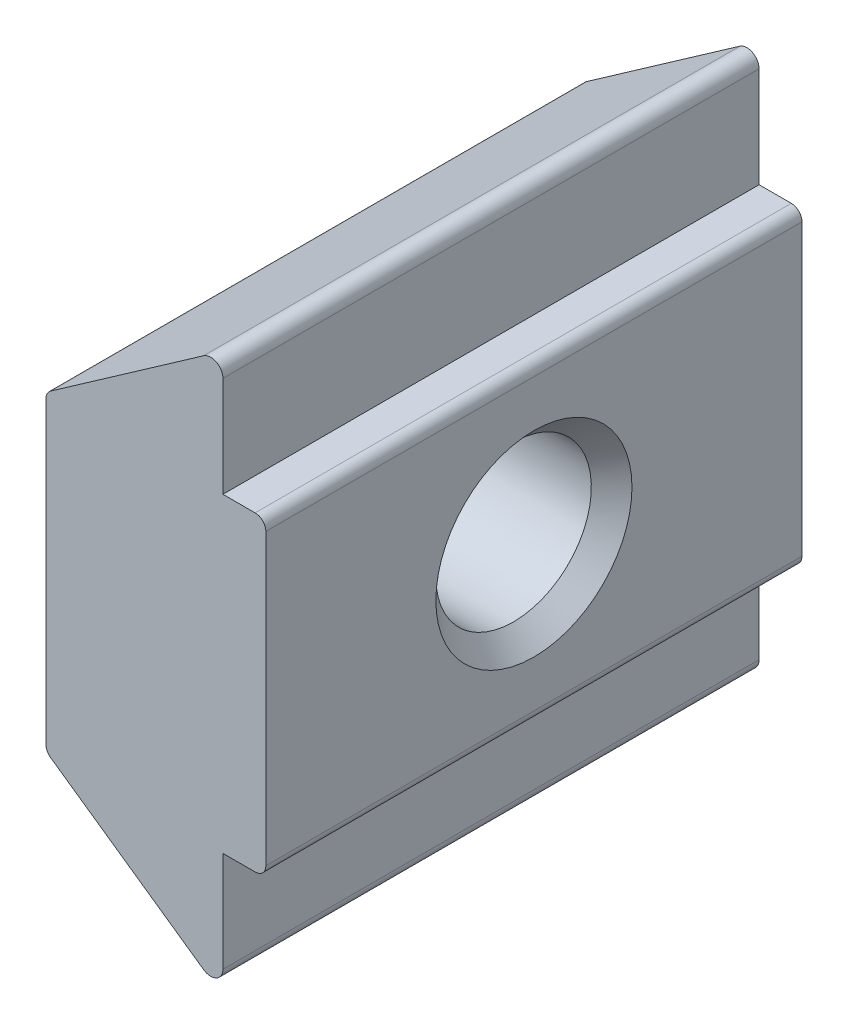
ISO-10303-21;
HEADER;
FILE_DESCRIPTION(('STEP AP214'),'2;1');
FILE_NAME('part.step','',(''),(''),'','','');
FILE_SCHEMA(('AUTOMOTIVE_DESIGN { 1 0 10303 214 1 1 1 1 }'));
ENDSEC;
DATA;
#1=APPLICATION_CONTEXT('core data for automotive mechanical design processes');
#2=APPLICATION_PROTOCOL_DEFINITION('international standard','automotive_design',2000,#1);
#3=PRODUCT_CONTEXT('',#1,'mechanical');
#4=PRODUCT('Part','Part','',(#3));
#5=PRODUCT_RELATED_PRODUCT_CATEGORY('part','',(#4));
#6=PRODUCT_DEFINITION_FORMATION('','',#4);
#7=PRODUCT_DEFINITION_CONTEXT('part definition',#1,'design');
#8=PRODUCT_DEFINITION('design','',#6,#7);
#9=PRODUCT_DEFINITION_SHAPE('','',#8);
#10=(LENGTH_UNIT() NAMED_UNIT(*) SI_UNIT(.MILLI.,.METRE.));
#11=(NAMED_UNIT(*) PLANE_ANGLE_UNIT() SI_UNIT($,.RADIAN.));
#12=(NAMED_UNIT(*) SI_UNIT($,.STERADIAN.) SOLID_ANGLE_UNIT());
#13=UNCERTAINTY_MEASURE_WITH_UNIT(LENGTH_MEASURE(1.E-05),#10,'distance_accuracy_value','');
#14=(GEOMETRIC_REPRESENTATION_CONTEXT(3) GLOBAL_UNCERTAINTY_ASSIGNED_CONTEXT((#13)) GLOBAL_UNIT_ASSIGNED_CONTEXT((#10,
#11,#12)) REPRESENTATION_CONTEXT('',''));
#15=CARTESIAN_POINT('',(0.,0.,0.));
#16=DIRECTION('',(0.,0.,1.));
#17=DIRECTION('',(1.,0.,0.));
#18=AXIS2_PLACEMENT_3D('',#15,#16,#17);
#19=CARTESIAN_POINT('',(-0.799999999997916,-4.7718984664115,-5.));
#20=DIRECTION('',(1.,0.,0.));
#21=DIRECTION('',(0.,1.,0.));
#22=AXIS2_PLACEMENT_3D('',#19,#20,#21);
#23=PLANE('',#22);
#24=DIRECTION('',(0.,1.,0.));
#25=VECTOR('',#24,1.);
#26=CARTESIAN_POINT('',(-0.799999999997916,-4.7718984664115,5.));
#27=LINE('',#26,#25);
#28=CARTESIAN_POINT('',(-0.799999999997916,2.9,5.));
#29=VERTEX_POINT('',#28);
#30=CARTESIAN_POINT('',(-0.799999999997916,4.77189846641149,5.));
#31=VERTEX_POINT('',#30);
#32=EDGE_CURVE('E162',#29,#31,#27,.T.);
#33=ORIENTED_EDGE('',*,*,#32,.F.);
#34=DIRECTION('',(0.,0.,1.));
#35=VECTOR('',#34,1.);
#36=CARTESIAN_POINT('',(-0.799999999997916,2.9,5.));
#37=LINE('',#36,#35);
#38=CARTESIAN_POINT('',(-0.799999999997916,2.9,-5.));
#39=VERTEX_POINT('',#38);
#40=EDGE_CURVE('E155',#39,#29,#37,.T.);
#41=ORIENTED_EDGE('',*,*,#40,.F.);
#42=DIRECTION('',(0.,1.,0.));
#43=VECTOR('',#42,1.);
#44=CARTESIAN_POINT('',(-0.799999999997916,-4.7718984664115,-5.));
#45=LINE('',#44,#43);
#46=CARTESIAN_POINT('',(-0.799999999997916,4.77189846641149,-5.));
#47=VERTEX_POINT('',#46);
#48=EDGE_CURVE('E241',#39,#47,#45,.T.);
#49=ORIENTED_EDGE('',*,*,#48,.T.);
#50=DIRECTION('',(0.,0.,1.));
#51=VECTOR('',#50,1.);
#52=CARTESIAN_POINT('',(-0.799999999997916,4.77189846641149,-5.));
#53=LINE('',#52,#51);
#54=EDGE_CURVE('E183',#47,#31,#53,.T.);
#55=ORIENTED_EDGE('',*,*,#54,.T.);
#56=EDGE_LOOP('',(#33,#41,#49,#55));
#57=FACE_BOUND('',#56,.T.);
#58=ADVANCED_FACE('F35',(#57),#23,.T.);
#59=CARTESIAN_POINT('',(-0.799999999997916,-4.7718984664115,-5.));
#60=VERTEX_POINT('',#59);
#61=CARTESIAN_POINT('',(-0.799999999997916,-2.9,-5.));
#62=VERTEX_POINT('',#61);
#63=EDGE_CURVE('E153',#60,#62,#45,.T.);
#64=ORIENTED_EDGE('',*,*,#63,.T.);
#65=DIRECTION('',(0.,0.,-1.));
#66=VECTOR('',#65,1.);
#67=CARTESIAN_POINT('',(-0.799999999997916,-2.9,-5.));
#68=LINE('',#67,#66);
#69=CARTESIAN_POINT('',(-0.799999999997916,-2.9,5.));
#70=VERTEX_POINT('',#69);
#71=EDGE_CURVE('E138',#70,#62,#68,.T.);
#72=ORIENTED_EDGE('',*,*,#71,.F.);
#73=CARTESIAN_POINT('',(-0.799999999997916,-4.7718984664115,5.));
#74=VERTEX_POINT('',#73);
#75=EDGE_CURVE('E150',#74,#70,#27,.T.);
#76=ORIENTED_EDGE('',*,*,#75,.F.);
#77=DIRECTION('',(0.,0.,1.));
#78=VECTOR('',#77,1.);
#79=CARTESIAN_POINT('',(-0.799999999997916,-4.7718984664115,-5.));
#80=LINE('',#79,#78);
#81=EDGE_CURVE('E186',#60,#74,#80,.T.);
#82=ORIENTED_EDGE('',*,*,#81,.F.);
#83=EDGE_LOOP('',(#64,#72,#76,#82));
#84=FACE_BOUND('',#83,.T.);
#85=ADVANCED_FACE('F149',(#84),#23,.T.);
#86=CARTESIAN_POINT('',(-1.02809999999535,-4.7718984664115,-5.));
#87=DIRECTION('',(0.,0.,1.));
#88=DIRECTION('',(1.,0.,0.));
#89=AXIS2_PLACEMENT_3D('',#86,#87,#88);
#90=CYLINDRICAL_SURFACE('',#89,0.228099999997434);
#91=CARTESIAN_POINT('',(-1.02809999999535,-4.7718984664115,5.));
#92=DIRECTION('',(0.,0.,1.));
#93=DIRECTION('',(1.,0.,0.));
#94=AXIS2_PLACEMENT_3D('',#91,#92,#93);
#95=CIRCLE('',#94,0.228099999997434);
#96=CARTESIAN_POINT('',(-1.15890676074315,-4.95876526747979,5.));
#97=VERTEX_POINT('',#96);
#98=EDGE_CURVE('E160',#97,#74,#95,.T.);
#99=ORIENTED_EDGE('',*,*,#98,.F.);
#100=DIRECTION('',(0.,0.,1.));
#101=VECTOR('',#100,1.);
#102=CARTESIAN_POINT('',(-1.15890676074315,-4.95876526747979,-5.));
#103=LINE('',#102,#101);
#104=CARTESIAN_POINT('',(-1.15890676074315,-4.95876526747979,-5.));
#105=VERTEX_POINT('',#104);
#106=EDGE_CURVE('E177',#105,#97,#103,.T.);
#107=ORIENTED_EDGE('',*,*,#106,.F.);
#108=CARTESIAN_POINT('',(-1.02809999999535,-4.7718984664115,-5.));
#109=DIRECTION('',(0.,0.,1.));
#110=DIRECTION('',(1.,0.,0.));
#111=AXIS2_PLACEMENT_3D('',#108,#109,#110);
#112=CIRCLE('',#111,0.228099999997434);
#113=EDGE_CURVE('E176',#105,#60,#112,.T.);
#114=ORIENTED_EDGE('',*,*,#113,.T.);
#115=ORIENTED_EDGE('',*,*,#81,.T.);
#116=EDGE_LOOP('',(#99,#107,#114,#115));
#117=FACE_BOUND('',#116,.T.);
#118=ADVANCED_FACE('F276',(#117),#90,.T.);
#119=CARTESIAN_POINT('',(-4.1,-2.9,-5.));
#120=DIRECTION('',(-0.573462344363329,-0.81923192051904,0.));
#121=DIRECTION('',(0.81923192051904,-0.573462344363329,0.));
#122=AXIS2_PLACEMENT_3D('',#119,#120,#121);
#123=PLANE('',#122);
#124=DIRECTION('',(0.81923192051904,-0.573462344363329,0.));
#125=VECTOR('',#124,1.);
#126=CARTESIAN_POINT('',(-4.1,-2.9,5.));
#127=LINE('',#126,#125);
#128=CARTESIAN_POINT('',(-4.01469246887267,-2.95971527178913,5.));
#129=VERTEX_POINT('',#128);
#130=EDGE_CURVE('E174',#129,#97,#127,.T.);
#131=ORIENTED_EDGE('',*,*,#130,.F.);
#132=DIRECTION('',(0.,0.,1.));
#133=VECTOR('',#132,1.);
#134=CARTESIAN_POINT('',(-4.01469246887267,-2.95971527178913,-5.));
#135=LINE('',#134,#133);
#136=CARTESIAN_POINT('',(-4.01469246887267,-2.95971527178913,-5.));
#137=VERTEX_POINT('',#136);
#138=EDGE_CURVE('E213',#129,#137,#135,.F.);
#139=ORIENTED_EDGE('',*,*,#138,.T.);
#140=DIRECTION('',(0.81923192051904,-0.573462344363329,0.));
#141=VECTOR('',#140,1.);
#142=CARTESIAN_POINT('',(-4.1,-2.9,-5.));
#143=LINE('',#142,#141);
#144=EDGE_CURVE('E188',#137,#105,#143,.T.);
#145=ORIENTED_EDGE('',*,*,#144,.T.);
#146=ORIENTED_EDGE('',*,*,#106,.T.);
#147=EDGE_LOOP('',(#131,#139,#145,#146));
#148=FACE_BOUND('',#147,.T.);
#149=ADVANCED_FACE('F271',(#148),#123,.T.);
#150=CARTESIAN_POINT('',(-4.1,2.9,-5.));
#151=DIRECTION('',(-1.,0.,0.));
#152=DIRECTION('',(0.,0.,1.));
#153=AXIS2_PLACEMENT_3D('',#150,#151,#152);
#154=PLANE('',#153);
#155=CARTESIAN_POINT('',(-4.1,0.,0.));
#156=DIRECTION('',(-1.,0.,0.));
#157=DIRECTION('',(0.,0.,1.));
#158=AXIS2_PLACEMENT_3D('',#155,#156,#157);
#159=CIRCLE('',#158,1.82899999994793);
#160=CARTESIAN_POINT('',(-4.1,0.,1.82899999994793));
#161=VERTEX_POINT('',#160);
#162=EDGE_CURVE('E180',#161,#161,#159,.F.);
#163=ORIENTED_EDGE('',*,*,#162,.T.);
#164=EDGE_LOOP('',(#163));
#165=FACE_BOUND('',#164,.T.);
#166=DIRECTION('',(0.,-1.,0.));
#167=VECTOR('',#166,1.);
#168=CARTESIAN_POINT('',(-4.1,2.9,-5.));
#169=LINE('',#168,#167);
#170=CARTESIAN_POINT('',(-4.1,2.79586888768533,-5.));
#171=VERTEX_POINT('',#170);
#172=CARTESIAN_POINT('',(-4.1,-2.79586888768532,-5.));
#173=VERTEX_POINT('',#172);
#174=EDGE_CURVE('E266',#171,#173,#169,.T.);
#175=ORIENTED_EDGE('',*,*,#174,.T.);
#176=DIRECTION('',(0.,0.,1.));
#177=VECTOR('',#176,1.);
#178=CARTESIAN_POINT('',(-4.1,-2.79586888768533,-5.));
#179=LINE('',#178,#177);
#180=CARTESIAN_POINT('',(-4.1,-2.79586888768532,5.));
#181=VERTEX_POINT('',#180);
#182=EDGE_CURVE('E202',#173,#181,#179,.T.);
#183=ORIENTED_EDGE('',*,*,#182,.T.);
#184=DIRECTION('',(0.,-1.,0.));
#185=VECTOR('',#184,1.);
#186=CARTESIAN_POINT('',(-4.1,2.9,5.));
#187=LINE('',#186,#185);
#188=CARTESIAN_POINT('',(-4.1,2.79586888768533,5.));
#189=VERTEX_POINT('',#188);
#190=EDGE_CURVE('E172',#189,#181,#187,.T.);
#191=ORIENTED_EDGE('',*,*,#190,.F.);
#192=DIRECTION('',(0.,0.,1.));
#193=VECTOR('',#192,1.);
#194=CARTESIAN_POINT('',(-4.1,2.79586888768533,-5.));
#195=LINE('',#194,#193);
#196=EDGE_CURVE('E200',#189,#171,#195,.F.);
#197=ORIENTED_EDGE('',*,*,#196,.T.);
#198=EDGE_LOOP('',(#175,#183,#191,#197));
#199=FACE_BOUND('',#198,.T.);
#200=ADVANCED_FACE('F326',(#165,#199),#154,.T.);
#201=CARTESIAN_POINT('',(-1.15890676074317,4.95876526747979,-5.));
#202=DIRECTION('',(-0.573462344363328,0.81923192051904,0.));
#203=DIRECTION('',(-0.81923192051904,-0.573462344363328,0.));
#204=AXIS2_PLACEMENT_3D('',#201,#202,#203);
#205=PLANE('',#204);
#206=DIRECTION('',(-0.81923192051904,-0.573462344363328,0.));
#207=VECTOR('',#206,1.);
#208=CARTESIAN_POINT('',(-1.15890676074317,4.95876526747979,-5.));
#209=LINE('',#208,#207);
#210=CARTESIAN_POINT('',(-1.15890676074317,4.95876526747979,-5.));
#211=VERTEX_POINT('',#210);
#212=CARTESIAN_POINT('',(-4.01469246887267,2.95971527178914,-5.));
#213=VERTEX_POINT('',#212);
#214=EDGE_CURVE('E263',#211,#213,#209,.T.);
#215=ORIENTED_EDGE('',*,*,#214,.T.);
#216=DIRECTION('',(0.,0.,1.));
#217=VECTOR('',#216,1.);
#218=CARTESIAN_POINT('',(-4.01469246887267,2.95971527178914,-5.));
#219=LINE('',#218,#217);
#220=CARTESIAN_POINT('',(-4.01469246887267,2.95971527178914,5.));
#221=VERTEX_POINT('',#220);
#222=EDGE_CURVE('E221',#213,#221,#219,.T.);
#223=ORIENTED_EDGE('',*,*,#222,.T.);
#224=DIRECTION('',(-0.81923192051904,-0.573462344363328,0.));
#225=VECTOR('',#224,1.);
#226=CARTESIAN_POINT('',(-1.15890676074317,4.95876526747979,5.));
#227=LINE('',#226,#225);
#228=CARTESIAN_POINT('',(-1.15890676074317,4.95876526747979,5.));
#229=VERTEX_POINT('',#228);
#230=EDGE_CURVE('E165',#229,#221,#227,.T.);
#231=ORIENTED_EDGE('',*,*,#230,.F.);
#232=DIRECTION('',(0.,0.,1.));
#233=VECTOR('',#232,1.);
#234=CARTESIAN_POINT('',(-1.15890676074317,4.95876526747979,-5.));
#235=LINE('',#234,#233);
#236=EDGE_CURVE('E181',#211,#229,#235,.T.);
#237=ORIENTED_EDGE('',*,*,#236,.F.);
#238=EDGE_LOOP('',(#215,#223,#231,#237));
#239=FACE_BOUND('',#238,.T.);
#240=ADVANCED_FACE('F319',(#239),#205,.T.);
#241=CARTESIAN_POINT('',(-1.02809999999536,4.77189846641149,-5.));
#242=DIRECTION('',(0.,0.,1.));
#243=DIRECTION('',(1.,0.,0.));
#244=AXIS2_PLACEMENT_3D('',#241,#242,#243);
#245=CYLINDRICAL_SURFACE('',#244,0.228099999997443);
#246=CARTESIAN_POINT('',(-1.02809999999536,4.77189846641149,5.));
#247=DIRECTION('',(0.,0.,1.));
#248=DIRECTION('',(1.,0.,0.));
#249=AXIS2_PLACEMENT_3D('',#246,#247,#248);
#250=CIRCLE('',#249,0.228099999997443);
#251=EDGE_CURVE('E161',#31,#229,#250,.T.);
#252=ORIENTED_EDGE('',*,*,#251,.F.);
#253=ORIENTED_EDGE('',*,*,#54,.F.);
#254=CARTESIAN_POINT('',(-1.02809999999536,4.77189846641149,-5.));
#255=DIRECTION('',(0.,0.,1.));
#256=DIRECTION('',(1.,0.,0.));
#257=AXIS2_PLACEMENT_3D('',#254,#255,#256);
#258=CIRCLE('',#257,0.228099999997443);
#259=EDGE_CURVE('E260',#47,#211,#258,.T.);
#260=ORIENTED_EDGE('',*,*,#259,.T.);
#261=ORIENTED_EDGE('',*,*,#236,.T.);
#262=EDGE_LOOP('',(#252,#253,#260,#261));
#263=FACE_BOUND('',#262,.T.);
#264=ADVANCED_FACE('F292',(#263),#245,.T.);
#265=CARTESIAN_POINT('',(-1.02809999999535,-4.7718984664115,-5.));
#266=DIRECTION('',(0.,0.,1.));
#267=DIRECTION('',(1.,0.,0.));
#268=AXIS2_PLACEMENT_3D('',#265,#266,#267);
#269=PLANE('',#268);
#270=ORIENTED_EDGE('',*,*,#144,.F.);
#271=CARTESIAN_POINT('',(-3.9,-2.79586888768533,-5.));
#272=DIRECTION('',(0.,0.,1.));
#273=DIRECTION('',(1.,0.,0.));
#274=AXIS2_PLACEMENT_3D('',#271,#272,#273);
#275=CIRCLE('',#274,0.200000000000001);
#276=EDGE_CURVE('E219',#137,#173,#275,.F.);
#277=ORIENTED_EDGE('',*,*,#276,.T.);
#278=ORIENTED_EDGE('',*,*,#174,.F.);
#279=CARTESIAN_POINT('',(-3.9,2.79586888768533,-5.));
#280=DIRECTION('',(0.,0.,1.));
#281=DIRECTION('',(1.,0.,0.));
#282=AXIS2_PLACEMENT_3D('',#279,#280,#281);
#283=CIRCLE('',#282,0.200000000000001);
#284=EDGE_CURVE('E217',#171,#213,#283,.F.);
#285=ORIENTED_EDGE('',*,*,#284,.T.);
#286=ORIENTED_EDGE('',*,*,#214,.F.);
#287=ORIENTED_EDGE('',*,*,#259,.F.);
#288=ORIENTED_EDGE('',*,*,#48,.F.);
#289=DIRECTION('',(-1.,0.,0.));
#290=VECTOR('',#289,1.);
#291=CARTESIAN_POINT('',(2.08416183616889E-12,2.9,-5.));
#292=LINE('',#291,#290);
#293=CARTESIAN_POINT('',(-0.199999999997917,2.9,-5.));
#294=VERTEX_POINT('',#293);
#295=EDGE_CURVE('E234',#294,#39,#292,.T.);
#296=ORIENTED_EDGE('',*,*,#295,.F.);
#297=CARTESIAN_POINT('',(-0.199999999997917,2.7,-5.));
#298=DIRECTION('',(0.,0.,1.));
#299=DIRECTION('',(1.,0.,0.));
#300=AXIS2_PLACEMENT_3D('',#297,#298,#299);
#301=CIRCLE('',#300,0.200000000000001);
#302=CARTESIAN_POINT('',(2.08414688165616E-12,2.7,-5.));
#303=VERTEX_POINT('',#302);
#304=EDGE_CURVE('E56',#294,#303,#301,.F.);
#305=ORIENTED_EDGE('',*,*,#304,.T.);
#306=DIRECTION('',(0.,1.,0.));
#307=VECTOR('',#306,1.);
#308=CARTESIAN_POINT('',(2.08416183616889E-12,2.9,-5.));
#309=LINE('',#308,#307);
#310=CARTESIAN_POINT('',(2.08374310981261E-12,-2.7,-5.));
#311=VERTEX_POINT('',#310);
#312=EDGE_CURVE('E242',#311,#303,#309,.T.);
#313=ORIENTED_EDGE('',*,*,#312,.F.);
#314=CARTESIAN_POINT('',(-0.199999999997917,-2.7,-5.));
#315=DIRECTION('',(0.,0.,1.));
#316=DIRECTION('',(1.,0.,0.));
#317=AXIS2_PLACEMENT_3D('',#314,#315,#316);
#318=CIRCLE('',#317,0.200000000000001);
#319=CARTESIAN_POINT('',(-0.199999999997917,-2.9,-5.));
#320=VERTEX_POINT('',#319);
#321=EDGE_CURVE('E50',#311,#320,#318,.F.);
#322=ORIENTED_EDGE('',*,*,#321,.T.);
#323=DIRECTION('',(-1.,0.,0.));
#324=VECTOR('',#323,1.);
#325=CARTESIAN_POINT('',(2.08372815529989E-12,-2.9,-5.));
#326=LINE('',#325,#324);
#327=EDGE_CURVE('E145',#320,#62,#326,.T.);
#328=ORIENTED_EDGE('',*,*,#327,.T.);
#329=ORIENTED_EDGE('',*,*,#63,.F.);
#330=ORIENTED_EDGE('',*,*,#113,.F.);
#331=EDGE_LOOP('',(#270,#277,#278,#285,#286,#287,#288,#296,#305,#313,#322,#328,#329,#330));
#332=FACE_BOUND('',#331,.T.);
#333=ADVANCED_FACE('F239',(#332),#269,.F.);
#334=CARTESIAN_POINT('',(-1.02809999999535,-4.7718984664115,5.));
#335=DIRECTION('',(0.,0.,1.));
#336=DIRECTION('',(1.,0.,0.));
#337=AXIS2_PLACEMENT_3D('',#334,#335,#336);
#338=PLANE('',#337);
#339=ORIENTED_EDGE('',*,*,#190,.T.);
#340=CARTESIAN_POINT('',(-3.9,-2.79586888768533,5.));
#341=DIRECTION('',(0.,0.,1.));
#342=DIRECTION('',(1.,0.,0.));
#343=AXIS2_PLACEMENT_3D('',#340,#341,#342);
#344=CIRCLE('',#343,0.200000000000001);
#345=EDGE_CURVE('E211',#181,#129,#344,.T.);
#346=ORIENTED_EDGE('',*,*,#345,.T.);
#347=ORIENTED_EDGE('',*,*,#130,.T.);
#348=ORIENTED_EDGE('',*,*,#98,.T.);
#349=ORIENTED_EDGE('',*,*,#75,.T.);
#350=DIRECTION('',(-1.,0.,0.));
#351=VECTOR('',#350,1.);
#352=CARTESIAN_POINT('',(2.08372815529989E-12,-2.9,5.));
#353=LINE('',#352,#351);
#354=CARTESIAN_POINT('',(-0.199999999997917,-2.9,5.));
#355=VERTEX_POINT('',#354);
#356=EDGE_CURVE('E135',#355,#70,#353,.T.);
#357=ORIENTED_EDGE('',*,*,#356,.F.);
#358=CARTESIAN_POINT('',(-0.199999999997917,-2.7,5.));
#359=DIRECTION('',(0.,0.,1.));
#360=DIRECTION('',(1.,0.,0.));
#361=AXIS2_PLACEMENT_3D('',#358,#359,#360);
#362=CIRCLE('',#361,0.200000000000001);
#363=CARTESIAN_POINT('',(2.08374310981261E-12,-2.7,5.));
#364=VERTEX_POINT('',#363);
#365=EDGE_CURVE('E205',#355,#364,#362,.T.);
#366=ORIENTED_EDGE('',*,*,#365,.T.);
#367=DIRECTION('',(0.,-1.,0.));
#368=VECTOR('',#367,1.);
#369=CARTESIAN_POINT('',(2.08372815529989E-12,-2.9,5.));
#370=LINE('',#369,#368);
#371=CARTESIAN_POINT('',(2.08414688165616E-12,2.7,5.));
#372=VERTEX_POINT('',#371);
#373=EDGE_CURVE('E154',#372,#364,#370,.T.);
#374=ORIENTED_EDGE('',*,*,#373,.F.);
#375=CARTESIAN_POINT('',(-0.199999999997917,2.7,5.));
#376=DIRECTION('',(0.,0.,1.));
#377=DIRECTION('',(1.,0.,0.));
#378=AXIS2_PLACEMENT_3D('',#375,#376,#377);
#379=CIRCLE('',#378,0.200000000000001);
#380=CARTESIAN_POINT('',(-0.199999999997917,2.9,5.));
#381=VERTEX_POINT('',#380);
#382=EDGE_CURVE('E207',#372,#381,#379,.T.);
#383=ORIENTED_EDGE('',*,*,#382,.T.);
#384=DIRECTION('',(-1.,0.,0.));
#385=VECTOR('',#384,1.);
#386=CARTESIAN_POINT('',(2.08416183616889E-12,2.9,5.));
#387=LINE('',#386,#385);
#388=EDGE_CURVE('E144',#381,#29,#387,.T.);
#389=ORIENTED_EDGE('',*,*,#388,.T.);
#390=ORIENTED_EDGE('',*,*,#32,.T.);
#391=ORIENTED_EDGE('',*,*,#251,.T.);
#392=ORIENTED_EDGE('',*,*,#230,.T.);
#393=CARTESIAN_POINT('',(-3.9,2.79586888768533,5.));
#394=DIRECTION('',(0.,0.,1.));
#395=DIRECTION('',(1.,0.,0.));
#396=AXIS2_PLACEMENT_3D('',#393,#394,#395);
#397=CIRCLE('',#396,0.200000000000001);
#398=EDGE_CURVE('E209',#221,#189,#397,.T.);
#399=ORIENTED_EDGE('',*,*,#398,.T.);
#400=EDGE_LOOP('',(#339,#346,#347,#348,#349,#357,#366,#374,#383,#389,#390,#391,#392,#399));
#401=FACE_BOUND('',#400,.T.);
#402=ADVANCED_FACE('F158',(#401),#338,.T.);
#403=CARTESIAN_POINT('',(2.08416183616889E-12,2.9,5.));
#404=DIRECTION('',(0.,-1.,0.));
#405=DIRECTION('',(1.,0.,0.));
#406=AXIS2_PLACEMENT_3D('',#403,#404,#405);
#407=PLANE('',#406);
#408=ORIENTED_EDGE('',*,*,#388,.F.);
#409=DIRECTION('',(0.,0.,1.));
#410=VECTOR('',#409,1.);
#411=CARTESIAN_POINT('',(-0.199999999997917,2.9,5.));
#412=LINE('',#411,#410);
#413=EDGE_CURVE('E43',#381,#294,#412,.F.);
#414=ORIENTED_EDGE('',*,*,#413,.T.);
#415=ORIENTED_EDGE('',*,*,#295,.T.);
#416=ORIENTED_EDGE('',*,*,#40,.T.);
#417=EDGE_LOOP('',(#408,#414,#415,#416));
#418=FACE_BOUND('',#417,.T.);
#419=ADVANCED_FACE('F232',(#418),#407,.F.);
#420=CARTESIAN_POINT('',(2.08372815529989E-12,-2.9,-5.));
#421=DIRECTION('',(0.,1.,0.));
#422=DIRECTION('',(-1.,0.,0.));
#423=AXIS2_PLACEMENT_3D('',#420,#421,#422);
#424=PLANE('',#423);
#425=ORIENTED_EDGE('',*,*,#327,.F.);
#426=DIRECTION('',(0.,0.,-1.));
#427=VECTOR('',#426,1.);
#428=CARTESIAN_POINT('',(-0.199999999997917,-2.9,-5.));
#429=LINE('',#428,#427);
#430=EDGE_CURVE('E11',#320,#355,#429,.F.);
#431=ORIENTED_EDGE('',*,*,#430,.T.);
#432=ORIENTED_EDGE('',*,*,#356,.T.);
#433=ORIENTED_EDGE('',*,*,#71,.T.);
#434=EDGE_LOOP('',(#425,#431,#432,#433));
#435=FACE_BOUND('',#434,.T.);
#436=ADVANCED_FACE('F137',(#435),#424,.F.);
#437=CARTESIAN_POINT('',(2.08394499573439E-12,0.,0.));
#438=DIRECTION('',(-1.,0.,0.));
#439=DIRECTION('',(0.,-1.,0.));
#440=AXIS2_PLACEMENT_3D('',#437,#438,#439);
#441=PLANE('',#440);
#442=CARTESIAN_POINT('',(2.08394499573439E-12,0.,0.));
#443=DIRECTION('',(-1.,0.,0.));
#444=DIRECTION('',(0.,-1.,0.));
#445=AXIS2_PLACEMENT_3D('',#442,#443,#444);
#446=CIRCLE('',#445,1.82899999995002);
#447=CARTESIAN_POINT('',(2.08380823671553E-12,-1.82899999995002,0.));
#448=VERTEX_POINT('',#447);
#449=EDGE_CURVE('E197',#448,#448,#446,.T.);
#450=ORIENTED_EDGE('',*,*,#449,.T.);
#451=EDGE_LOOP('',(#450));
#452=FACE_BOUND('',#451,.T.);
#453=ORIENTED_EDGE('',*,*,#312,.T.);
#454=DIRECTION('',(0.,0.,1.));
#455=VECTOR('',#454,1.);
#456=CARTESIAN_POINT('',(2.08414688165616E-12,2.7,0.));
#457=LINE('',#456,#455);
#458=EDGE_CURVE('E227',#303,#372,#457,.T.);
#459=ORIENTED_EDGE('',*,*,#458,.T.);
#460=ORIENTED_EDGE('',*,*,#373,.T.);
#461=DIRECTION('',(0.,0.,-1.));
#462=VECTOR('',#461,1.);
#463=CARTESIAN_POINT('',(2.08374310981261E-12,-2.7,0.));
#464=LINE('',#463,#462);
#465=EDGE_CURVE('E224',#364,#311,#464,.T.);
#466=ORIENTED_EDGE('',*,*,#465,.T.);
#467=EDGE_LOOP('',(#453,#459,#460,#466));
#468=FACE_BOUND('',#467,.T.);
#469=ADVANCED_FACE('F249',(#452,#468),#441,.F.);
#470=CARTESIAN_POINT('',(0.,0.,0.));
#471=DIRECTION('',(1.,0.,0.));
#472=DIRECTION('',(0.,0.,-1.));
#473=AXIS2_PLACEMENT_3D('',#470,#471,#472);
#474=CYLINDRICAL_SURFACE('',#473,1.45);
#475=CARTESIAN_POINT('',(-3.72100000005207,0.,0.));
#476=DIRECTION('',(-1.,0.,0.));
#477=DIRECTION('',(0.,0.,1.));
#478=AXIS2_PLACEMENT_3D('',#475,#476,#477);
#479=CIRCLE('',#478,1.45);
#480=CARTESIAN_POINT('',(-3.72100000005207,0.,1.45));
#481=VERTEX_POINT('',#480);
#482=EDGE_CURVE('E194',#481,#481,#479,.T.);
#483=ORIENTED_EDGE('',*,*,#482,.T.);
#484=EDGE_LOOP('',(#483));
#485=FACE_BOUND('',#484,.T.);
#486=CARTESIAN_POINT('',(-0.378999999947933,0.,0.));
#487=DIRECTION('',(-1.,0.,0.));
#488=DIRECTION('',(0.,0.,1.));
#489=AXIS2_PLACEMENT_3D('',#486,#487,#488);
#490=CIRCLE('',#489,1.45);
#491=CARTESIAN_POINT('',(-0.378999999947933,0.,1.45));
#492=VERTEX_POINT('',#491);
#493=EDGE_CURVE('E191',#492,#492,#490,.F.);
#494=ORIENTED_EDGE('',*,*,#493,.T.);
#495=EDGE_LOOP('',(#494));
#496=FACE_BOUND('',#495,.T.);
#497=ADVANCED_FACE('F300',(#485,#496),#474,.F.);
#498=CARTESIAN_POINT('',(-4.1,0.,0.));
#499=DIRECTION('',(-1.,0.,0.));
#500=DIRECTION('',(0.,0.,1.));
#501=AXIS2_PLACEMENT_3D('',#498,#499,#500);
#502=CONICAL_SURFACE('',#501,1.82899999994793,0.785398163397445);
#503=ORIENTED_EDGE('',*,*,#482,.F.);
#504=EDGE_LOOP('',(#503));
#505=FACE_BOUND('',#504,.T.);
#506=ORIENTED_EDGE('',*,*,#162,.F.);
#507=EDGE_LOOP('',(#506));
#508=FACE_BOUND('',#507,.T.);
#509=ADVANCED_FACE('F296',(#505,#508),#502,.F.);
#510=CARTESIAN_POINT('',(-0.378999999947933,0.,0.));
#511=DIRECTION('',(1.,0.,0.));
#512=DIRECTION('',(0.,0.,-1.));
#513=AXIS2_PLACEMENT_3D('',#510,#511,#512);
#514=CONICAL_SURFACE('',#513,1.45,0.785398163397451);
#515=ORIENTED_EDGE('',*,*,#449,.F.);
#516=EDGE_LOOP('',(#515));
#517=FACE_BOUND('',#516,.T.);
#518=ORIENTED_EDGE('',*,*,#493,.F.);
#519=EDGE_LOOP('',(#518));
#520=FACE_BOUND('',#519,.T.);
#521=ADVANCED_FACE('F299',(#517,#520),#514,.F.);
#522=CARTESIAN_POINT('',(-3.9,-2.79586888768533,-5.));
#523=DIRECTION('',(0.,0.,1.));
#524=DIRECTION('',(1.,0.,0.));
#525=AXIS2_PLACEMENT_3D('',#522,#523,#524);
#526=CYLINDRICAL_SURFACE('',#525,0.200000000000001);
#527=ORIENTED_EDGE('',*,*,#276,.F.);
#528=ORIENTED_EDGE('',*,*,#138,.F.);
#529=ORIENTED_EDGE('',*,*,#345,.F.);
#530=ORIENTED_EDGE('',*,*,#182,.F.);
#531=EDGE_LOOP('',(#527,#528,#529,#530));
#532=FACE_BOUND('',#531,.T.);
#533=ADVANCED_FACE('F304',(#532),#526,.T.);
#534=CARTESIAN_POINT('',(-3.9,2.79586888768533,-5.));
#535=DIRECTION('',(0.,0.,1.));
#536=DIRECTION('',(1.,0.,0.));
#537=AXIS2_PLACEMENT_3D('',#534,#535,#536);
#538=CYLINDRICAL_SURFACE('',#537,0.200000000000001);
#539=ORIENTED_EDGE('',*,*,#284,.F.);
#540=ORIENTED_EDGE('',*,*,#196,.F.);
#541=ORIENTED_EDGE('',*,*,#398,.F.);
#542=ORIENTED_EDGE('',*,*,#222,.F.);
#543=EDGE_LOOP('',(#539,#540,#541,#542));
#544=FACE_BOUND('',#543,.T.);
#545=ADVANCED_FACE('F282',(#544),#538,.T.);
#546=CARTESIAN_POINT('',(-0.199999999997917,2.7,0.));
#547=DIRECTION('',(0.,0.,1.));
#548=DIRECTION('',(1.,0.,0.));
#549=AXIS2_PLACEMENT_3D('',#546,#547,#548);
#550=CYLINDRICAL_SURFACE('',#549,0.200000000000001);
#551=ORIENTED_EDGE('',*,*,#304,.F.);
#552=ORIENTED_EDGE('',*,*,#413,.F.);
#553=ORIENTED_EDGE('',*,*,#382,.F.);
#554=ORIENTED_EDGE('',*,*,#458,.F.);
#555=EDGE_LOOP('',(#551,#552,#553,#554));
#556=FACE_BOUND('',#555,.T.);
#557=ADVANCED_FACE('F245',(#556),#550,.T.);
#558=CARTESIAN_POINT('',(-0.199999999997917,-2.7,0.));
#559=DIRECTION('',(0.,0.,-1.));
#560=DIRECTION('',(-1.,0.,0.));
#561=AXIS2_PLACEMENT_3D('',#558,#559,#560);
#562=CYLINDRICAL_SURFACE('',#561,0.200000000000001);
#563=ORIENTED_EDGE('',*,*,#365,.F.);
#564=ORIENTED_EDGE('',*,*,#430,.F.);
#565=ORIENTED_EDGE('',*,*,#321,.F.);
#566=ORIENTED_EDGE('',*,*,#465,.F.);
#567=EDGE_LOOP('',(#563,#564,#565,#566));
#568=FACE_BOUND('',#567,.T.);
#569=ADVANCED_FACE('F37',(#568),#562,.T.);
#570=CLOSED_SHELL('',(#58,#85,#118,#149,#200,#240,#264,#333,#402,#419,#436,#469,#497,#509,#521,
#533,#545,#557,#569));
#571=MANIFOLD_SOLID_BREP('B2',#570);
#572=ADVANCED_BREP_SHAPE_REPRESENTATION('',(#18,#571),#14);
#573=SHAPE_DEFINITION_REPRESENTATION(#9,#572);
ENDSEC;
END-ISO-10303-21;
